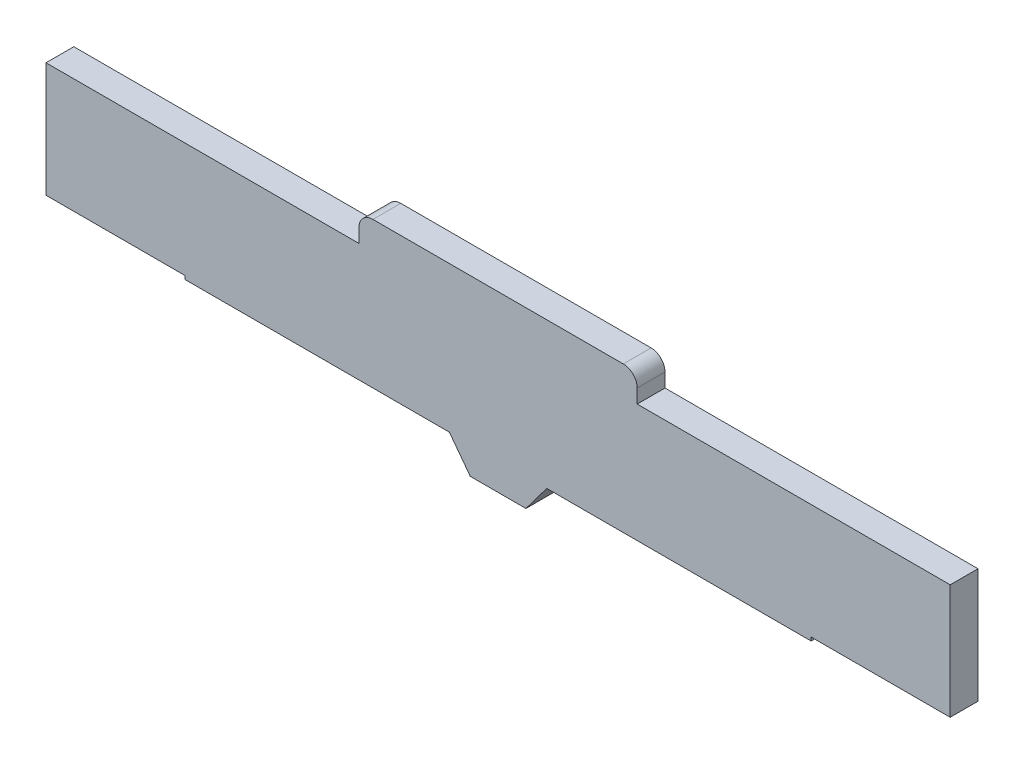
ISO-10303-21;
HEADER;
FILE_DESCRIPTION(('STEP AP214'),'2;1');
FILE_NAME('part.step','',(''),(''),'','','');
FILE_SCHEMA(('AUTOMOTIVE_DESIGN { 1 0 10303 214 1 1 1 1 }'));
ENDSEC;
DATA;
#1=APPLICATION_CONTEXT('core data for automotive mechanical design processes');
#2=APPLICATION_PROTOCOL_DEFINITION('international standard','automotive_design',2000,#1);
#3=PRODUCT_CONTEXT('',#1,'mechanical');
#4=PRODUCT('Part','Part','',(#3));
#5=PRODUCT_RELATED_PRODUCT_CATEGORY('part','',(#4));
#6=PRODUCT_DEFINITION_FORMATION('','',#4);
#7=PRODUCT_DEFINITION_CONTEXT('part definition',#1,'design');
#8=PRODUCT_DEFINITION('design','',#6,#7);
#9=PRODUCT_DEFINITION_SHAPE('','',#8);
#10=(LENGTH_UNIT() NAMED_UNIT(*) SI_UNIT(.MILLI.,.METRE.));
#11=(NAMED_UNIT(*) PLANE_ANGLE_UNIT() SI_UNIT($,.RADIAN.));
#12=(NAMED_UNIT(*) SI_UNIT($,.STERADIAN.) SOLID_ANGLE_UNIT());
#13=UNCERTAINTY_MEASURE_WITH_UNIT(LENGTH_MEASURE(1.E-05),#10,'distance_accuracy_value','');
#14=(GEOMETRIC_REPRESENTATION_CONTEXT(3) GLOBAL_UNCERTAINTY_ASSIGNED_CONTEXT((#13)) GLOBAL_UNIT_ASSIGNED_CONTEXT((#10,
#11,#12)) REPRESENTATION_CONTEXT('',''));
#15=CARTESIAN_POINT('',(0.,0.,0.));
#16=DIRECTION('',(0.,0.,1.));
#17=DIRECTION('',(1.,0.,0.));
#18=AXIS2_PLACEMENT_3D('',#15,#16,#17);
#19=CARTESIAN_POINT('',(-48.8292382073789,-20.0792382073789,2.));
#20=DIRECTION('',(0.,1.,0.));
#21=DIRECTION('',(0.,0.,1.));
#22=AXIS2_PLACEMENT_3D('',#19,#20,#21);
#23=PLANE('',#22);
#24=DIRECTION('',(1.,0.,0.));
#25=VECTOR('',#24,1.);
#26=CARTESIAN_POINT('',(-48.8292382073789,-20.0792382073789,0.));
#27=LINE('',#26,#25);
#28=CARTESIAN_POINT('',(-48.8292382073789,-20.0792382073789,0.));
#29=VERTEX_POINT('',#28);
#30=CARTESIAN_POINT('',(-38.8292382073789,-20.0792382073789,0.));
#31=VERTEX_POINT('',#30);
#32=EDGE_CURVE('E186',#29,#31,#27,.T.);
#33=ORIENTED_EDGE('',*,*,#32,.T.);
#34=DIRECTION('',(0.,0.,-1.));
#35=VECTOR('',#34,1.);
#36=CARTESIAN_POINT('',(-38.8292382073789,-20.0792382073789,2.));
#37=LINE('',#36,#35);
#38=CARTESIAN_POINT('',(-38.8292382073789,-20.0792382073789,2.));
#39=VERTEX_POINT('',#38);
#40=EDGE_CURVE('E11',#39,#31,#37,.T.);
#41=ORIENTED_EDGE('',*,*,#40,.F.);
#42=DIRECTION('',(1.,0.,0.));
#43=VECTOR('',#42,1.);
#44=CARTESIAN_POINT('',(-48.8292382073789,-20.0792382073789,2.));
#45=LINE('',#44,#43);
#46=CARTESIAN_POINT('',(-48.8292382073789,-20.0792382073789,2.));
#47=VERTEX_POINT('',#46);
#48=EDGE_CURVE('E221',#47,#39,#45,.T.);
#49=ORIENTED_EDGE('',*,*,#48,.F.);
#50=DIRECTION('',(0.,0.,-1.));
#51=VECTOR('',#50,1.);
#52=CARTESIAN_POINT('',(-48.8292382073789,-20.0792382073789,2.));
#53=LINE('',#52,#51);
#54=EDGE_CURVE('E182',#47,#29,#53,.T.);
#55=ORIENTED_EDGE('',*,*,#54,.T.);
#56=EDGE_LOOP('',(#33,#41,#49,#55));
#57=FACE_BOUND('',#56,.T.);
#58=ADVANCED_FACE('F30',(#57),#23,.F.);
#59=CARTESIAN_POINT('',(-38.8292382073789,-20.0792382073789,2.));
#60=DIRECTION('',(1.,0.,0.));
#61=DIRECTION('',(0.,0.,-1.));
#62=AXIS2_PLACEMENT_3D('',#59,#60,#61);
#63=PLANE('',#62);
#64=DIRECTION('',(0.,-1.,0.));
#65=VECTOR('',#64,1.);
#66=CARTESIAN_POINT('',(-38.8292382073789,-20.0792382073789,0.));
#67=LINE('',#66,#65);
#68=CARTESIAN_POINT('',(-38.8292382073789,-20.3292382073789,0.));
#69=VERTEX_POINT('',#68);
#70=EDGE_CURVE('E189',#31,#69,#67,.T.);
#71=ORIENTED_EDGE('',*,*,#70,.T.);
#72=DIRECTION('',(0.,0.,-1.));
#73=VECTOR('',#72,1.);
#74=CARTESIAN_POINT('',(-38.8292382073789,-20.3292382073789,2.));
#75=LINE('',#74,#73);
#76=CARTESIAN_POINT('',(-38.8292382073789,-20.3292382073789,2.));
#77=VERTEX_POINT('',#76);
#78=EDGE_CURVE('E38',#77,#69,#75,.T.);
#79=ORIENTED_EDGE('',*,*,#78,.F.);
#80=DIRECTION('',(0.,-1.,0.));
#81=VECTOR('',#80,1.);
#82=CARTESIAN_POINT('',(-38.8292382073789,-20.0792382073789,2.));
#83=LINE('',#82,#81);
#84=EDGE_CURVE('E119',#39,#77,#83,.T.);
#85=ORIENTED_EDGE('',*,*,#84,.F.);
#86=ORIENTED_EDGE('',*,*,#40,.T.);
#87=EDGE_LOOP('',(#71,#79,#85,#86));
#88=FACE_BOUND('',#87,.T.);
#89=ADVANCED_FACE('F328',(#88),#63,.F.);
#90=CARTESIAN_POINT('',(-38.8292382073789,-20.3292382073789,2.));
#91=DIRECTION('',(0.,1.,0.));
#92=DIRECTION('',(0.,0.,1.));
#93=AXIS2_PLACEMENT_3D('',#90,#91,#92);
#94=PLANE('',#93);
#95=DIRECTION('',(1.,0.,0.));
#96=VECTOR('',#95,1.);
#97=CARTESIAN_POINT('',(-38.8292382073789,-20.3292382073789,0.));
#98=LINE('',#97,#96);
#99=CARTESIAN_POINT('',(-19.8292382073789,-20.3292382073789,0.));
#100=VERTEX_POINT('',#99);
#101=EDGE_CURVE('E191',#69,#100,#98,.T.);
#102=ORIENTED_EDGE('',*,*,#101,.T.);
#103=DIRECTION('',(0.,0.,-1.));
#104=VECTOR('',#103,1.);
#105=CARTESIAN_POINT('',(-19.8292382073789,-20.3292382073789,2.));
#106=LINE('',#105,#104);
#107=CARTESIAN_POINT('',(-19.8292382073789,-20.3292382073789,2.));
#108=VERTEX_POINT('',#107);
#109=EDGE_CURVE('E258',#108,#100,#106,.T.);
#110=ORIENTED_EDGE('',*,*,#109,.F.);
#111=DIRECTION('',(1.,0.,0.));
#112=VECTOR('',#111,1.);
#113=CARTESIAN_POINT('',(-38.8292382073789,-20.3292382073789,2.));
#114=LINE('',#113,#112);
#115=EDGE_CURVE('E266',#77,#108,#114,.T.);
#116=ORIENTED_EDGE('',*,*,#115,.F.);
#117=ORIENTED_EDGE('',*,*,#78,.T.);
#118=EDGE_LOOP('',(#102,#110,#116,#117));
#119=FACE_BOUND('',#118,.T.);
#120=ADVANCED_FACE('F264',(#119),#94,.F.);
#121=CARTESIAN_POINT('',(-19.8292382073789,-20.3292382073789,2.));
#122=DIRECTION('',(0.8,0.600000000000001,0.));
#123=DIRECTION('',(-0.6,0.8,0.));
#124=AXIS2_PLACEMENT_3D('',#121,#122,#123);
#125=PLANE('',#124);
#126=DIRECTION('',(0.6,-0.8,0.));
#127=VECTOR('',#126,1.);
#128=CARTESIAN_POINT('',(-19.8292382073789,-20.3292382073789,0.));
#129=LINE('',#128,#127);
#130=CARTESIAN_POINT('',(-18.3292382073789,-22.3292382073789,0.));
#131=VERTEX_POINT('',#130);
#132=EDGE_CURVE('E193',#100,#131,#129,.T.);
#133=ORIENTED_EDGE('',*,*,#132,.T.);
#134=DIRECTION('',(0.,0.,-1.));
#135=VECTOR('',#134,1.);
#136=CARTESIAN_POINT('',(-18.3292382073789,-22.3292382073789,2.));
#137=LINE('',#136,#135);
#138=CARTESIAN_POINT('',(-18.3292382073789,-22.3292382073789,2.));
#139=VERTEX_POINT('',#138);
#140=EDGE_CURVE('E255',#139,#131,#137,.T.);
#141=ORIENTED_EDGE('',*,*,#140,.F.);
#142=DIRECTION('',(0.6,-0.8,0.));
#143=VECTOR('',#142,1.);
#144=CARTESIAN_POINT('',(-19.8292382073789,-20.3292382073789,2.));
#145=LINE('',#144,#143);
#146=EDGE_CURVE('E283',#108,#139,#145,.T.);
#147=ORIENTED_EDGE('',*,*,#146,.F.);
#148=ORIENTED_EDGE('',*,*,#109,.T.);
#149=EDGE_LOOP('',(#133,#141,#147,#148));
#150=FACE_BOUND('',#149,.T.);
#151=ADVANCED_FACE('F274',(#150),#125,.F.);
#152=CARTESIAN_POINT('',(-16.3292382073789,-22.3292382073789,2.));
#153=DIRECTION('',(0.,1.,0.));
#154=DIRECTION('',(0.,0.,1.));
#155=AXIS2_PLACEMENT_3D('',#152,#153,#154);
#156=PLANE('',#155);
#157=DIRECTION('',(1.,0.,0.));
#158=VECTOR('',#157,1.);
#159=CARTESIAN_POINT('',(-16.3292382073789,-22.3292382073789,0.));
#160=LINE('',#159,#158);
#161=CARTESIAN_POINT('',(-14.3292382073789,-22.3292382073789,0.));
#162=VERTEX_POINT('',#161);
#163=EDGE_CURVE('E196',#131,#162,#160,.T.);
#164=ORIENTED_EDGE('',*,*,#163,.T.);
#165=DIRECTION('',(0.,0.,-1.));
#166=VECTOR('',#165,1.);
#167=CARTESIAN_POINT('',(-14.3292382073789,-22.3292382073789,2.));
#168=LINE('',#167,#166);
#169=CARTESIAN_POINT('',(-14.3292382073789,-22.3292382073789,2.));
#170=VERTEX_POINT('',#169);
#171=EDGE_CURVE('E252',#170,#162,#168,.T.);
#172=ORIENTED_EDGE('',*,*,#171,.F.);
#173=DIRECTION('',(1.,0.,0.));
#174=VECTOR('',#173,1.);
#175=CARTESIAN_POINT('',(-16.3292382073789,-22.3292382073789,2.));
#176=LINE('',#175,#174);
#177=EDGE_CURVE('E280',#139,#170,#176,.T.);
#178=ORIENTED_EDGE('',*,*,#177,.F.);
#179=ORIENTED_EDGE('',*,*,#140,.T.);
#180=EDGE_LOOP('',(#164,#172,#178,#179));
#181=FACE_BOUND('',#180,.T.);
#182=ADVANCED_FACE('F278',(#181),#156,.F.);
#183=CARTESIAN_POINT('',(-12.8292382073789,-20.3292382073789,2.));
#184=DIRECTION('',(-0.799999999999999,0.600000000000001,0.));
#185=DIRECTION('',(-0.600000000000001,-0.799999999999999,0.));
#186=AXIS2_PLACEMENT_3D('',#183,#184,#185);
#187=PLANE('',#186);
#188=DIRECTION('',(0.600000000000001,0.799999999999999,0.));
#189=VECTOR('',#188,1.);
#190=CARTESIAN_POINT('',(-12.8292382073789,-20.3292382073789,0.));
#191=LINE('',#190,#189);
#192=CARTESIAN_POINT('',(-12.8292382073789,-20.3292382073789,0.));
#193=VERTEX_POINT('',#192);
#194=EDGE_CURVE('E198',#162,#193,#191,.T.);
#195=ORIENTED_EDGE('',*,*,#194,.T.);
#196=DIRECTION('',(0.,0.,-1.));
#197=VECTOR('',#196,1.);
#198=CARTESIAN_POINT('',(-12.8292382073789,-20.3292382073789,2.));
#199=LINE('',#198,#197);
#200=CARTESIAN_POINT('',(-12.8292382073789,-20.3292382073789,2.));
#201=VERTEX_POINT('',#200);
#202=EDGE_CURVE('E249',#201,#193,#199,.T.);
#203=ORIENTED_EDGE('',*,*,#202,.F.);
#204=DIRECTION('',(0.600000000000001,0.799999999999999,0.));
#205=VECTOR('',#204,1.);
#206=CARTESIAN_POINT('',(-12.8292382073789,-20.3292382073789,2.));
#207=LINE('',#206,#205);
#208=EDGE_CURVE('E282',#170,#201,#207,.T.);
#209=ORIENTED_EDGE('',*,*,#208,.F.);
#210=ORIENTED_EDGE('',*,*,#171,.T.);
#211=EDGE_LOOP('',(#195,#203,#209,#210));
#212=FACE_BOUND('',#211,.T.);
#213=ADVANCED_FACE('F341',(#212),#187,.F.);
#214=CARTESIAN_POINT('',(-12.8292382073789,-20.3292382073789,2.));
#215=DIRECTION('',(0.,1.,0.));
#216=DIRECTION('',(0.,0.,1.));
#217=AXIS2_PLACEMENT_3D('',#214,#215,#216);
#218=PLANE('',#217);
#219=DIRECTION('',(1.,0.,0.));
#220=VECTOR('',#219,1.);
#221=CARTESIAN_POINT('',(-12.8292382073789,-20.3292382073789,0.));
#222=LINE('',#221,#220);
#223=CARTESIAN_POINT('',(6.17076179262114,-20.3292382073789,0.));
#224=VERTEX_POINT('',#223);
#225=EDGE_CURVE('E200',#193,#224,#222,.T.);
#226=ORIENTED_EDGE('',*,*,#225,.T.);
#227=DIRECTION('',(0.,0.,-1.));
#228=VECTOR('',#227,1.);
#229=CARTESIAN_POINT('',(6.17076179262114,-20.3292382073789,2.));
#230=LINE('',#229,#228);
#231=CARTESIAN_POINT('',(6.17076179262114,-20.3292382073789,2.));
#232=VERTEX_POINT('',#231);
#233=EDGE_CURVE('E246',#232,#224,#230,.T.);
#234=ORIENTED_EDGE('',*,*,#233,.F.);
#235=DIRECTION('',(1.,0.,0.));
#236=VECTOR('',#235,1.);
#237=CARTESIAN_POINT('',(-12.8292382073789,-20.3292382073789,2.));
#238=LINE('',#237,#236);
#239=EDGE_CURVE('E285',#201,#232,#238,.T.);
#240=ORIENTED_EDGE('',*,*,#239,.F.);
#241=ORIENTED_EDGE('',*,*,#202,.T.);
#242=EDGE_LOOP('',(#226,#234,#240,#241));
#243=FACE_BOUND('',#242,.T.);
#244=ADVANCED_FACE('F344',(#243),#218,.F.);
#245=CARTESIAN_POINT('',(6.17076179262114,-20.0792382073789,2.));
#246=DIRECTION('',(-1.,0.,0.));
#247=DIRECTION('',(0.,-1.,0.));
#248=AXIS2_PLACEMENT_3D('',#245,#246,#247);
#249=PLANE('',#248);
#250=DIRECTION('',(0.,1.,0.));
#251=VECTOR('',#250,1.);
#252=CARTESIAN_POINT('',(6.17076179262114,-20.0792382073789,0.));
#253=LINE('',#252,#251);
#254=CARTESIAN_POINT('',(6.17076179262114,-20.0792382073789,0.));
#255=VERTEX_POINT('',#254);
#256=EDGE_CURVE('E202',#224,#255,#253,.T.);
#257=ORIENTED_EDGE('',*,*,#256,.T.);
#258=DIRECTION('',(0.,0.,-1.));
#259=VECTOR('',#258,1.);
#260=CARTESIAN_POINT('',(6.17076179262114,-20.0792382073789,2.));
#261=LINE('',#260,#259);
#262=CARTESIAN_POINT('',(6.17076179262114,-20.0792382073789,2.));
#263=VERTEX_POINT('',#262);
#264=EDGE_CURVE('E243',#263,#255,#261,.T.);
#265=ORIENTED_EDGE('',*,*,#264,.F.);
#266=DIRECTION('',(0.,1.,0.));
#267=VECTOR('',#266,1.);
#268=CARTESIAN_POINT('',(6.17076179262114,-20.0792382073789,2.));
#269=LINE('',#268,#267);
#270=EDGE_CURVE('E291',#232,#263,#269,.T.);
#271=ORIENTED_EDGE('',*,*,#270,.F.);
#272=ORIENTED_EDGE('',*,*,#233,.T.);
#273=EDGE_LOOP('',(#257,#265,#271,#272));
#274=FACE_BOUND('',#273,.T.);
#275=ADVANCED_FACE('F348',(#274),#249,.F.);
#276=CARTESIAN_POINT('',(6.17076179262114,-20.0792382073789,2.));
#277=DIRECTION('',(0.,1.,0.));
#278=DIRECTION('',(0.,0.,1.));
#279=AXIS2_PLACEMENT_3D('',#276,#277,#278);
#280=PLANE('',#279);
#281=DIRECTION('',(1.,0.,0.));
#282=VECTOR('',#281,1.);
#283=CARTESIAN_POINT('',(6.17076179262114,-20.0792382073789,0.));
#284=LINE('',#283,#282);
#285=CARTESIAN_POINT('',(16.1707617926211,-20.0792382073789,0.));
#286=VERTEX_POINT('',#285);
#287=EDGE_CURVE('E204',#255,#286,#284,.T.);
#288=ORIENTED_EDGE('',*,*,#287,.T.);
#289=DIRECTION('',(0.,0.,-1.));
#290=VECTOR('',#289,1.);
#291=CARTESIAN_POINT('',(16.1707617926211,-20.0792382073789,2.));
#292=LINE('',#291,#290);
#293=CARTESIAN_POINT('',(16.1707617926211,-20.0792382073789,2.));
#294=VERTEX_POINT('',#293);
#295=EDGE_CURVE('E240',#294,#286,#292,.T.);
#296=ORIENTED_EDGE('',*,*,#295,.F.);
#297=DIRECTION('',(1.,0.,0.));
#298=VECTOR('',#297,1.);
#299=CARTESIAN_POINT('',(6.17076179262114,-20.0792382073789,2.));
#300=LINE('',#299,#298);
#301=EDGE_CURVE('E293',#263,#294,#300,.T.);
#302=ORIENTED_EDGE('',*,*,#301,.F.);
#303=ORIENTED_EDGE('',*,*,#264,.T.);
#304=EDGE_LOOP('',(#288,#296,#302,#303));
#305=FACE_BOUND('',#304,.T.);
#306=ADVANCED_FACE('F352',(#305),#280,.F.);
#307=CARTESIAN_POINT('',(16.1707617926211,-11.8292382073789,2.));
#308=DIRECTION('',(-1.,0.,0.));
#309=DIRECTION('',(0.,0.,1.));
#310=AXIS2_PLACEMENT_3D('',#307,#308,#309);
#311=PLANE('',#310);
#312=DIRECTION('',(0.,1.,0.));
#313=VECTOR('',#312,1.);
#314=CARTESIAN_POINT('',(16.1707617926211,-11.8292382073789,0.));
#315=LINE('',#314,#313);
#316=CARTESIAN_POINT('',(16.1707617926211,-11.8292382073789,0.));
#317=VERTEX_POINT('',#316);
#318=EDGE_CURVE('E206',#286,#317,#315,.T.);
#319=ORIENTED_EDGE('',*,*,#318,.T.);
#320=DIRECTION('',(0.,0.,-1.));
#321=VECTOR('',#320,1.);
#322=CARTESIAN_POINT('',(16.1707617926211,-11.8292382073789,2.));
#323=LINE('',#322,#321);
#324=CARTESIAN_POINT('',(16.1707617926211,-11.8292382073789,2.));
#325=VERTEX_POINT('',#324);
#326=EDGE_CURVE('E237',#325,#317,#323,.T.);
#327=ORIENTED_EDGE('',*,*,#326,.F.);
#328=DIRECTION('',(0.,1.,0.));
#329=VECTOR('',#328,1.);
#330=CARTESIAN_POINT('',(16.1707617926211,-11.8292382073789,2.));
#331=LINE('',#330,#329);
#332=EDGE_CURVE('E295',#294,#325,#331,.T.);
#333=ORIENTED_EDGE('',*,*,#332,.F.);
#334=ORIENTED_EDGE('',*,*,#295,.T.);
#335=EDGE_LOOP('',(#319,#327,#333,#334));
#336=FACE_BOUND('',#335,.T.);
#337=ADVANCED_FACE('F356',(#336),#311,.F.);
#338=CARTESIAN_POINT('',(-6.32923820737886,-11.8292382073789,2.));
#339=DIRECTION('',(0.,-1.,0.));
#340=DIRECTION('',(0.,0.,-1.));
#341=AXIS2_PLACEMENT_3D('',#338,#339,#340);
#342=PLANE('',#341);
#343=DIRECTION('',(-1.,0.,0.));
#344=VECTOR('',#343,1.);
#345=CARTESIAN_POINT('',(-6.32923820737886,-11.8292382073789,0.));
#346=LINE('',#345,#344);
#347=CARTESIAN_POINT('',(-6.32923820737886,-11.8292382073789,0.));
#348=VERTEX_POINT('',#347);
#349=EDGE_CURVE('E208',#317,#348,#346,.T.);
#350=ORIENTED_EDGE('',*,*,#349,.T.);
#351=DIRECTION('',(0.,0.,-1.));
#352=VECTOR('',#351,1.);
#353=CARTESIAN_POINT('',(-6.32923820737886,-11.8292382073789,2.));
#354=LINE('',#353,#352);
#355=CARTESIAN_POINT('',(-6.32923820737886,-11.8292382073789,2.));
#356=VERTEX_POINT('',#355);
#357=EDGE_CURVE('E234',#356,#348,#354,.T.);
#358=ORIENTED_EDGE('',*,*,#357,.F.);
#359=DIRECTION('',(-1.,0.,0.));
#360=VECTOR('',#359,1.);
#361=CARTESIAN_POINT('',(-6.32923820737886,-11.8292382073789,2.));
#362=LINE('',#361,#360);
#363=EDGE_CURVE('E297',#325,#356,#362,.T.);
#364=ORIENTED_EDGE('',*,*,#363,.F.);
#365=ORIENTED_EDGE('',*,*,#326,.T.);
#366=EDGE_LOOP('',(#350,#358,#364,#365));
#367=FACE_BOUND('',#366,.T.);
#368=ADVANCED_FACE('F360',(#367),#342,.F.);
#369=CARTESIAN_POINT('',(-6.32923820737886,-11.8292382073789,2.));
#370=DIRECTION('',(-1.,0.,0.));
#371=DIRECTION('',(0.,0.,1.));
#372=AXIS2_PLACEMENT_3D('',#369,#370,#371);
#373=PLANE('',#372);
#374=DIRECTION('',(0.,1.,0.));
#375=VECTOR('',#374,1.);
#376=CARTESIAN_POINT('',(-6.32923820737886,-11.8292382073789,0.));
#377=LINE('',#376,#375);
#378=CARTESIAN_POINT('',(-6.32923820737886,-10.8292382073789,0.));
#379=VERTEX_POINT('',#378);
#380=EDGE_CURVE('E210',#348,#379,#377,.T.);
#381=ORIENTED_EDGE('',*,*,#380,.T.);
#382=DIRECTION('',(0.,0.,-1.));
#383=VECTOR('',#382,1.);
#384=CARTESIAN_POINT('',(-6.32923820737886,-10.8292382073789,2.));
#385=LINE('',#384,#383);
#386=CARTESIAN_POINT('',(-6.32923820737886,-10.8292382073789,2.));
#387=VERTEX_POINT('',#386);
#388=EDGE_CURVE('E231',#387,#379,#385,.T.);
#389=ORIENTED_EDGE('',*,*,#388,.F.);
#390=DIRECTION('',(0.,1.,0.));
#391=VECTOR('',#390,1.);
#392=CARTESIAN_POINT('',(-6.32923820737886,-11.8292382073789,2.));
#393=LINE('',#392,#391);
#394=EDGE_CURVE('E299',#356,#387,#393,.T.);
#395=ORIENTED_EDGE('',*,*,#394,.F.);
#396=ORIENTED_EDGE('',*,*,#357,.T.);
#397=EDGE_LOOP('',(#381,#389,#395,#396));
#398=FACE_BOUND('',#397,.T.);
#399=ADVANCED_FACE('F364',(#398),#373,.F.);
#400=CARTESIAN_POINT('',(-7.32923820737886,-10.8292382073789,2.));
#401=DIRECTION('',(0.,0.,-1.));
#402=DIRECTION('',(-1.,0.,0.));
#403=AXIS2_PLACEMENT_3D('',#400,#401,#402);
#404=CYLINDRICAL_SURFACE('',#403,1.);
#405=CARTESIAN_POINT('',(-7.32923820737886,-10.8292382073789,0.));
#406=DIRECTION('',(0.,0.,1.));
#407=DIRECTION('',(-1.,0.,0.));
#408=AXIS2_PLACEMENT_3D('',#405,#406,#407);
#409=CIRCLE('',#408,1.);
#410=CARTESIAN_POINT('',(-7.32923820737887,-9.82923820737887,0.));
#411=VERTEX_POINT('',#410);
#412=EDGE_CURVE('E212',#379,#411,#409,.T.);
#413=ORIENTED_EDGE('',*,*,#412,.T.);
#414=DIRECTION('',(0.,0.,-1.));
#415=VECTOR('',#414,1.);
#416=CARTESIAN_POINT('',(-7.32923820737887,-9.82923820737887,2.));
#417=LINE('',#416,#415);
#418=CARTESIAN_POINT('',(-7.32923820737887,-9.82923820737887,2.));
#419=VERTEX_POINT('',#418);
#420=EDGE_CURVE('E228',#419,#411,#417,.T.);
#421=ORIENTED_EDGE('',*,*,#420,.F.);
#422=CARTESIAN_POINT('',(-7.32923820737886,-10.8292382073789,2.));
#423=DIRECTION('',(0.,0.,1.));
#424=DIRECTION('',(-1.,0.,0.));
#425=AXIS2_PLACEMENT_3D('',#422,#423,#424);
#426=CIRCLE('',#425,1.);
#427=EDGE_CURVE('E301',#387,#419,#426,.T.);
#428=ORIENTED_EDGE('',*,*,#427,.F.);
#429=ORIENTED_EDGE('',*,*,#388,.T.);
#430=EDGE_LOOP('',(#413,#421,#428,#429));
#431=FACE_BOUND('',#430,.T.);
#432=ADVANCED_FACE('F368',(#431),#404,.T.);
#433=CARTESIAN_POINT('',(-25.3292382073789,-9.82923820737887,2.));
#434=DIRECTION('',(0.,-1.,0.));
#435=DIRECTION('',(0.,0.,-1.));
#436=AXIS2_PLACEMENT_3D('',#433,#434,#435);
#437=PLANE('',#436);
#438=DIRECTION('',(-1.,0.,0.));
#439=VECTOR('',#438,1.);
#440=CARTESIAN_POINT('',(-25.3292382073789,-9.82923820737887,0.));
#441=LINE('',#440,#439);
#442=CARTESIAN_POINT('',(-25.3292382073789,-9.82923820737887,0.));
#443=VERTEX_POINT('',#442);
#444=EDGE_CURVE('E214',#411,#443,#441,.T.);
#445=ORIENTED_EDGE('',*,*,#444,.T.);
#446=DIRECTION('',(0.,0.,-1.));
#447=VECTOR('',#446,1.);
#448=CARTESIAN_POINT('',(-25.3292382073789,-9.82923820737887,2.));
#449=LINE('',#448,#447);
#450=CARTESIAN_POINT('',(-25.3292382073789,-9.82923820737887,2.));
#451=VERTEX_POINT('',#450);
#452=EDGE_CURVE('E225',#451,#443,#449,.T.);
#453=ORIENTED_EDGE('',*,*,#452,.F.);
#454=DIRECTION('',(-1.,0.,0.));
#455=VECTOR('',#454,1.);
#456=CARTESIAN_POINT('',(-25.3292382073789,-9.82923820737887,2.));
#457=LINE('',#456,#455);
#458=EDGE_CURVE('E303',#419,#451,#457,.T.);
#459=ORIENTED_EDGE('',*,*,#458,.F.);
#460=ORIENTED_EDGE('',*,*,#420,.T.);
#461=EDGE_LOOP('',(#445,#453,#459,#460));
#462=FACE_BOUND('',#461,.T.);
#463=ADVANCED_FACE('F309',(#462),#437,.F.);
#464=CARTESIAN_POINT('',(-25.3292382073789,-10.8292382073789,2.));
#465=DIRECTION('',(0.,0.,-1.));
#466=DIRECTION('',(-1.,0.,0.));
#467=AXIS2_PLACEMENT_3D('',#464,#465,#466);
#468=CYLINDRICAL_SURFACE('',#467,1.);
#469=CARTESIAN_POINT('',(-25.3292382073789,-10.8292382073789,0.));
#470=DIRECTION('',(0.,0.,1.));
#471=DIRECTION('',(1.,0.,0.));
#472=AXIS2_PLACEMENT_3D('',#469,#470,#471);
#473=CIRCLE('',#472,1.);
#474=CARTESIAN_POINT('',(-26.3292382073789,-10.8292382073789,0.));
#475=VERTEX_POINT('',#474);
#476=EDGE_CURVE('E216',#443,#475,#473,.T.);
#477=ORIENTED_EDGE('',*,*,#476,.T.);
#478=DIRECTION('',(0.,0.,-1.));
#479=VECTOR('',#478,1.);
#480=CARTESIAN_POINT('',(-26.3292382073789,-10.8292382073789,2.));
#481=LINE('',#480,#479);
#482=CARTESIAN_POINT('',(-26.3292382073789,-10.8292382073789,2.));
#483=VERTEX_POINT('',#482);
#484=EDGE_CURVE('E177',#483,#475,#481,.T.);
#485=ORIENTED_EDGE('',*,*,#484,.F.);
#486=CARTESIAN_POINT('',(-25.3292382073789,-10.8292382073789,2.));
#487=DIRECTION('',(0.,0.,1.));
#488=DIRECTION('',(1.,0.,0.));
#489=AXIS2_PLACEMENT_3D('',#486,#487,#488);
#490=CIRCLE('',#489,1.);
#491=EDGE_CURVE('E168',#451,#483,#490,.T.);
#492=ORIENTED_EDGE('',*,*,#491,.F.);
#493=ORIENTED_EDGE('',*,*,#452,.T.);
#494=EDGE_LOOP('',(#477,#485,#492,#493));
#495=FACE_BOUND('',#494,.T.);
#496=ADVANCED_FACE('F313',(#495),#468,.T.);
#497=CARTESIAN_POINT('',(-26.3292382073789,-11.8292382073789,2.));
#498=DIRECTION('',(1.,0.,0.));
#499=DIRECTION('',(0.,0.,-1.));
#500=AXIS2_PLACEMENT_3D('',#497,#498,#499);
#501=PLANE('',#500);
#502=DIRECTION('',(0.,-1.,0.));
#503=VECTOR('',#502,1.);
#504=CARTESIAN_POINT('',(-26.3292382073789,-11.8292382073789,0.));
#505=LINE('',#504,#503);
#506=CARTESIAN_POINT('',(-26.3292382073789,-11.8292382073789,0.));
#507=VERTEX_POINT('',#506);
#508=EDGE_CURVE('E176',#475,#507,#505,.T.);
#509=ORIENTED_EDGE('',*,*,#508,.T.);
#510=DIRECTION('',(0.,0.,-1.));
#511=VECTOR('',#510,1.);
#512=CARTESIAN_POINT('',(-26.3292382073789,-11.8292382073789,2.));
#513=LINE('',#512,#511);
#514=CARTESIAN_POINT('',(-26.3292382073789,-11.8292382073789,2.));
#515=VERTEX_POINT('',#514);
#516=EDGE_CURVE('E173',#515,#507,#513,.T.);
#517=ORIENTED_EDGE('',*,*,#516,.F.);
#518=DIRECTION('',(0.,-1.,0.));
#519=VECTOR('',#518,1.);
#520=CARTESIAN_POINT('',(-26.3292382073789,-11.8292382073789,2.));
#521=LINE('',#520,#519);
#522=EDGE_CURVE('E162',#483,#515,#521,.T.);
#523=ORIENTED_EDGE('',*,*,#522,.F.);
#524=ORIENTED_EDGE('',*,*,#484,.T.);
#525=EDGE_LOOP('',(#509,#517,#523,#524));
#526=FACE_BOUND('',#525,.T.);
#527=ADVANCED_FACE('F174',(#526),#501,.F.);
#528=CARTESIAN_POINT('',(-48.8292382073789,-11.8292382073789,2.));
#529=DIRECTION('',(0.,-1.,0.));
#530=DIRECTION('',(0.,0.,-1.));
#531=AXIS2_PLACEMENT_3D('',#528,#529,#530);
#532=PLANE('',#531);
#533=DIRECTION('',(-1.,0.,0.));
#534=VECTOR('',#533,1.);
#535=CARTESIAN_POINT('',(-48.8292382073789,-11.8292382073789,0.));
#536=LINE('',#535,#534);
#537=CARTESIAN_POINT('',(-48.8292382073789,-11.8292382073789,0.));
#538=VERTEX_POINT('',#537);
#539=EDGE_CURVE('E105',#507,#538,#536,.T.);
#540=ORIENTED_EDGE('',*,*,#539,.T.);
#541=DIRECTION('',(0.,0.,-1.));
#542=VECTOR('',#541,1.);
#543=CARTESIAN_POINT('',(-48.8292382073789,-11.8292382073789,2.));
#544=LINE('',#543,#542);
#545=CARTESIAN_POINT('',(-48.8292382073789,-11.8292382073789,2.));
#546=VERTEX_POINT('',#545);
#547=EDGE_CURVE('E178',#546,#538,#544,.T.);
#548=ORIENTED_EDGE('',*,*,#547,.F.);
#549=DIRECTION('',(-1.,0.,0.));
#550=VECTOR('',#549,1.);
#551=CARTESIAN_POINT('',(-48.8292382073789,-11.8292382073789,2.));
#552=LINE('',#551,#550);
#553=EDGE_CURVE('E166',#515,#546,#552,.T.);
#554=ORIENTED_EDGE('',*,*,#553,.F.);
#555=ORIENTED_EDGE('',*,*,#516,.T.);
#556=EDGE_LOOP('',(#540,#548,#554,#555));
#557=FACE_BOUND('',#556,.T.);
#558=ADVANCED_FACE('F180',(#557),#532,.F.);
#559=CARTESIAN_POINT('',(-48.8292382073789,-11.8292382073789,2.));
#560=DIRECTION('',(1.,0.,0.));
#561=DIRECTION('',(0.,0.,-1.));
#562=AXIS2_PLACEMENT_3D('',#559,#560,#561);
#563=PLANE('',#562);
#564=DIRECTION('',(0.,-1.,0.));
#565=VECTOR('',#564,1.);
#566=CARTESIAN_POINT('',(-48.8292382073789,-11.8292382073789,0.));
#567=LINE('',#566,#565);
#568=EDGE_CURVE('E111',#538,#29,#567,.T.);
#569=ORIENTED_EDGE('',*,*,#568,.T.);
#570=ORIENTED_EDGE('',*,*,#54,.F.);
#571=DIRECTION('',(0.,-1.,0.));
#572=VECTOR('',#571,1.);
#573=CARTESIAN_POINT('',(-48.8292382073789,-11.8292382073789,2.));
#574=LINE('',#573,#572);
#575=EDGE_CURVE('E46',#546,#47,#574,.T.);
#576=ORIENTED_EDGE('',*,*,#575,.F.);
#577=ORIENTED_EDGE('',*,*,#547,.T.);
#578=EDGE_LOOP('',(#569,#570,#576,#577));
#579=FACE_BOUND('',#578,.T.);
#580=ADVANCED_FACE('F317',(#579),#563,.F.);
#581=CARTESIAN_POINT('',(-7.32923820737886,-10.8292382073789,2.));
#582=DIRECTION('',(0.,0.,-1.));
#583=DIRECTION('',(-1.,0.,0.));
#584=AXIS2_PLACEMENT_3D('',#581,#582,#583);
#585=PLANE('',#584);
#586=ORIENTED_EDGE('',*,*,#48,.T.);
#587=ORIENTED_EDGE('',*,*,#84,.T.);
#588=ORIENTED_EDGE('',*,*,#115,.T.);
#589=ORIENTED_EDGE('',*,*,#146,.T.);
#590=ORIENTED_EDGE('',*,*,#177,.T.);
#591=ORIENTED_EDGE('',*,*,#208,.T.);
#592=ORIENTED_EDGE('',*,*,#239,.T.);
#593=ORIENTED_EDGE('',*,*,#270,.T.);
#594=ORIENTED_EDGE('',*,*,#301,.T.);
#595=ORIENTED_EDGE('',*,*,#332,.T.);
#596=ORIENTED_EDGE('',*,*,#363,.T.);
#597=ORIENTED_EDGE('',*,*,#394,.T.);
#598=ORIENTED_EDGE('',*,*,#427,.T.);
#599=ORIENTED_EDGE('',*,*,#458,.T.);
#600=ORIENTED_EDGE('',*,*,#491,.T.);
#601=ORIENTED_EDGE('',*,*,#522,.T.);
#602=ORIENTED_EDGE('',*,*,#553,.T.);
#603=ORIENTED_EDGE('',*,*,#575,.T.);
#604=EDGE_LOOP('',(#586,#587,#588,#589,#590,#591,#592,#593,#594,#595,#596,#597,#598,#599,#600,
#601,#602,#603));
#605=FACE_BOUND('',#604,.T.);
#606=ADVANCED_FACE('F164',(#605),#585,.F.);
#607=CARTESIAN_POINT('',(-7.32923820737886,-10.8292382073789,0.));
#608=DIRECTION('',(0.,0.,-1.));
#609=DIRECTION('',(-1.,0.,0.));
#610=AXIS2_PLACEMENT_3D('',#607,#608,#609);
#611=PLANE('',#610);
#612=ORIENTED_EDGE('',*,*,#32,.F.);
#613=ORIENTED_EDGE('',*,*,#568,.F.);
#614=ORIENTED_EDGE('',*,*,#539,.F.);
#615=ORIENTED_EDGE('',*,*,#508,.F.);
#616=ORIENTED_EDGE('',*,*,#476,.F.);
#617=ORIENTED_EDGE('',*,*,#444,.F.);
#618=ORIENTED_EDGE('',*,*,#412,.F.);
#619=ORIENTED_EDGE('',*,*,#380,.F.);
#620=ORIENTED_EDGE('',*,*,#349,.F.);
#621=ORIENTED_EDGE('',*,*,#318,.F.);
#622=ORIENTED_EDGE('',*,*,#287,.F.);
#623=ORIENTED_EDGE('',*,*,#256,.F.);
#624=ORIENTED_EDGE('',*,*,#225,.F.);
#625=ORIENTED_EDGE('',*,*,#194,.F.);
#626=ORIENTED_EDGE('',*,*,#163,.F.);
#627=ORIENTED_EDGE('',*,*,#132,.F.);
#628=ORIENTED_EDGE('',*,*,#101,.F.);
#629=ORIENTED_EDGE('',*,*,#70,.F.);
#630=EDGE_LOOP('',(#612,#613,#614,#615,#616,#617,#618,#619,#620,#621,#622,#623,#624,#625,#626,
#627,#628,#629));
#631=FACE_BOUND('',#630,.T.);
#632=ADVANCED_FACE('F270',(#631),#611,.T.);
#633=CLOSED_SHELL('',(#58,#89,#120,#151,#182,#213,#244,#275,#306,#337,#368,#399,#432,#463,#496,
#527,#558,#580,#606,#632));
#634=MANIFOLD_SOLID_BREP('B2',#633);
#635=ADVANCED_BREP_SHAPE_REPRESENTATION('',(#18,#634),#14);
#636=SHAPE_DEFINITION_REPRESENTATION(#9,#635);
ENDSEC;
END-ISO-10303-21;
